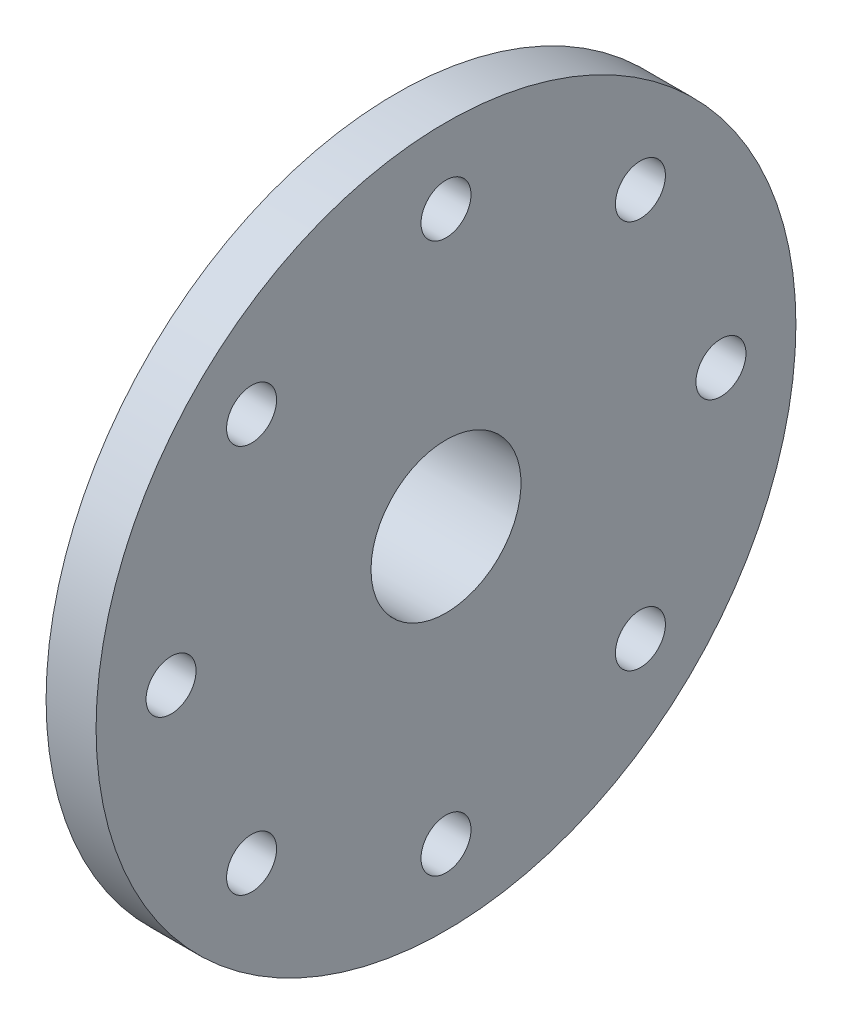
ISO-10303-21;
HEADER;
FILE_DESCRIPTION(('STEP AP214'),'2;1');
FILE_NAME('part.step','',(''),(''),'','','');
FILE_SCHEMA(('AUTOMOTIVE_DESIGN { 1 0 10303 214 1 1 1 1 }'));
ENDSEC;
DATA;
#1=APPLICATION_CONTEXT('core data for automotive mechanical design processes');
#2=APPLICATION_PROTOCOL_DEFINITION('international standard','automotive_design',2000,#1);
#3=PRODUCT_CONTEXT('',#1,'mechanical');
#4=PRODUCT('Part','Part','',(#3));
#5=PRODUCT_RELATED_PRODUCT_CATEGORY('part','',(#4));
#6=PRODUCT_DEFINITION_FORMATION('','',#4);
#7=PRODUCT_DEFINITION_CONTEXT('part definition',#1,'design');
#8=PRODUCT_DEFINITION('design','',#6,#7);
#9=PRODUCT_DEFINITION_SHAPE('','',#8);
#10=(LENGTH_UNIT() NAMED_UNIT(*) SI_UNIT(.MILLI.,.METRE.));
#11=(NAMED_UNIT(*) PLANE_ANGLE_UNIT() SI_UNIT($,.RADIAN.));
#12=(NAMED_UNIT(*) SI_UNIT($,.STERADIAN.) SOLID_ANGLE_UNIT());
#13=UNCERTAINTY_MEASURE_WITH_UNIT(LENGTH_MEASURE(1.E-05),#10,'distance_accuracy_value','');
#14=(GEOMETRIC_REPRESENTATION_CONTEXT(3) GLOBAL_UNCERTAINTY_ASSIGNED_CONTEXT((#13)) GLOBAL_UNIT_ASSIGNED_CONTEXT((#10,
#11,#12)) REPRESENTATION_CONTEXT('',''));
#15=CARTESIAN_POINT('',(0.,0.,0.));
#16=DIRECTION('',(0.,0.,1.));
#17=DIRECTION('',(1.,0.,0.));
#18=AXIS2_PLACEMENT_3D('',#15,#16,#17);
#19=CARTESIAN_POINT('',(-5.,1.5,0.));
#20=DIRECTION('',(1.,0.,0.));
#21=DIRECTION('',(0.,0.,-1.));
#22=AXIS2_PLACEMENT_3D('',#19,#20,#21);
#23=PLANE('',#22);
#24=CARTESIAN_POINT('',(-5.,0.,0.));
#25=DIRECTION('',(-1.,0.,0.));
#26=DIRECTION('',(0.,0.,1.));
#27=AXIS2_PLACEMENT_3D('',#24,#25,#26);
#28=CIRCLE('',#27,1.5);
#29=CARTESIAN_POINT('',(-5.,0.,1.5));
#30=VERTEX_POINT('',#29);
#31=EDGE_CURVE('E42',#30,#30,#28,.T.);
#32=ORIENTED_EDGE('',*,*,#31,.F.);
#33=EDGE_LOOP('',(#32));
#34=FACE_BOUND('',#33,.T.);
#35=CARTESIAN_POINT('',(-5.,0.,0.));
#36=DIRECTION('',(-1.,0.,0.));
#37=DIRECTION('',(0.,0.,1.));
#38=AXIS2_PLACEMENT_3D('',#35,#36,#37);
#39=CIRCLE('',#38,3.75);
#40=CARTESIAN_POINT('',(-5.,0.,3.75));
#41=VERTEX_POINT('',#40);
#42=EDGE_CURVE('E10',#41,#41,#39,.T.);
#43=ORIENTED_EDGE('',*,*,#42,.T.);
#44=EDGE_LOOP('',(#43));
#45=FACE_BOUND('',#44,.T.);
#46=ADVANCED_FACE('F14',(#34,#45),#23,.F.);
#47=CARTESIAN_POINT('',(0.,0.,0.));
#48=DIRECTION('',(-1.,0.,0.));
#49=DIRECTION('',(0.,0.,1.));
#50=AXIS2_PLACEMENT_3D('',#47,#48,#49);
#51=CYLINDRICAL_SURFACE('',#50,3.75);
#52=ORIENTED_EDGE('',*,*,#42,.F.);
#53=EDGE_LOOP('',(#52));
#54=FACE_BOUND('',#53,.T.);
#55=CARTESIAN_POINT('',(-2.,0.,0.));
#56=DIRECTION('',(-1.,0.,0.));
#57=DIRECTION('',(0.,0.,1.));
#58=AXIS2_PLACEMENT_3D('',#55,#56,#57);
#59=CIRCLE('',#58,3.75);
#60=CARTESIAN_POINT('',(-2.,0.,3.75));
#61=VERTEX_POINT('',#60);
#62=EDGE_CURVE('E20',#61,#61,#59,.T.);
#63=ORIENTED_EDGE('',*,*,#62,.T.);
#64=EDGE_LOOP('',(#63));
#65=FACE_BOUND('',#64,.T.);
#66=ADVANCED_FACE('F140',(#54,#65),#51,.T.);
#67=CARTESIAN_POINT('',(-2.,3.75,0.));
#68=DIRECTION('',(1.,0.,0.));
#69=DIRECTION('',(0.,0.,-1.));
#70=AXIS2_PLACEMENT_3D('',#67,#68,#69);
#71=PLANE('',#70);
#72=CARTESIAN_POINT('',(-2.,7.77817459305212,7.77817459305193));
#73=DIRECTION('',(1.,0.,0.));
#74=DIRECTION('',(0.,0.,-1.));
#75=AXIS2_PLACEMENT_3D('',#72,#73,#74);
#76=CIRCLE('',#75,1.);
#77=CARTESIAN_POINT('',(-2.,7.77817459305212,6.77817459305193));
#78=VERTEX_POINT('',#77);
#79=EDGE_CURVE('E87',#78,#78,#76,.T.);
#80=ORIENTED_EDGE('',*,*,#79,.T.);
#81=EDGE_LOOP('',(#80));
#82=FACE_BOUND('',#81,.T.);
#83=CARTESIAN_POINT('',(-2.,1.15218884181823E-13,11.));
#84=DIRECTION('',(1.,0.,0.));
#85=DIRECTION('',(0.,0.,-1.));
#86=AXIS2_PLACEMENT_3D('',#83,#84,#85);
#87=CIRCLE('',#86,1.);
#88=CARTESIAN_POINT('',(-2.,1.15218884181823E-13,10.));
#89=VERTEX_POINT('',#88);
#90=EDGE_CURVE('E81',#89,#89,#87,.T.);
#91=ORIENTED_EDGE('',*,*,#90,.T.);
#92=EDGE_LOOP('',(#91));
#93=FACE_BOUND('',#92,.T.);
#94=CARTESIAN_POINT('',(-2.,-7.77817459305195,7.77817459305209));
#95=DIRECTION('',(1.,0.,0.));
#96=DIRECTION('',(0.,0.,-1.));
#97=AXIS2_PLACEMENT_3D('',#94,#95,#96);
#98=CIRCLE('',#97,1.);
#99=CARTESIAN_POINT('',(-2.,-7.77817459305195,6.77817459305209));
#100=VERTEX_POINT('',#99);
#101=EDGE_CURVE('E75',#100,#100,#98,.T.);
#102=ORIENTED_EDGE('',*,*,#101,.T.);
#103=EDGE_LOOP('',(#102));
#104=FACE_BOUND('',#103,.T.);
#105=CARTESIAN_POINT('',(-2.,-11.,0.));
#106=DIRECTION('',(1.,0.,0.));
#107=DIRECTION('',(0.,0.,-1.));
#108=AXIS2_PLACEMENT_3D('',#105,#106,#107);
#109=CIRCLE('',#108,1.);
#110=CARTESIAN_POINT('',(-2.,-11.,-1.));
#111=VERTEX_POINT('',#110);
#112=EDGE_CURVE('E69',#111,#111,#109,.T.);
#113=ORIENTED_EDGE('',*,*,#112,.T.);
#114=EDGE_LOOP('',(#113));
#115=FACE_BOUND('',#114,.T.);
#116=CARTESIAN_POINT('',(-2.,-7.77817459305206,-7.77817459305198));
#117=DIRECTION('',(1.,0.,0.));
#118=DIRECTION('',(0.,0.,-1.));
#119=AXIS2_PLACEMENT_3D('',#116,#117,#118);
#120=CIRCLE('',#119,1.);
#121=CARTESIAN_POINT('',(-2.,-7.77817459305206,-8.77817459305198));
#122=VERTEX_POINT('',#121);
#123=EDGE_CURVE('E63',#122,#122,#120,.T.);
#124=ORIENTED_EDGE('',*,*,#123,.T.);
#125=EDGE_LOOP('',(#124));
#126=FACE_BOUND('',#125,.T.);
#127=CARTESIAN_POINT('',(-2.,0.,-11.));
#128=DIRECTION('',(1.,0.,0.));
#129=DIRECTION('',(0.,0.,-1.));
#130=AXIS2_PLACEMENT_3D('',#127,#128,#129);
#131=CIRCLE('',#130,1.);
#132=CARTESIAN_POINT('',(-2.,0.,-12.));
#133=VERTEX_POINT('',#132);
#134=EDGE_CURVE('E57',#133,#133,#131,.T.);
#135=ORIENTED_EDGE('',*,*,#134,.T.);
#136=EDGE_LOOP('',(#135));
#137=FACE_BOUND('',#136,.T.);
#138=CARTESIAN_POINT('',(-2.,7.77817459305201,-7.77817459305204));
#139=DIRECTION('',(1.,0.,0.));
#140=DIRECTION('',(0.,0.,-1.));
#141=AXIS2_PLACEMENT_3D('',#138,#139,#140);
#142=CIRCLE('',#141,1.);
#143=CARTESIAN_POINT('',(-2.,7.77817459305201,-8.77817459305204));
#144=VERTEX_POINT('',#143);
#145=EDGE_CURVE('E51',#144,#144,#142,.T.);
#146=ORIENTED_EDGE('',*,*,#145,.T.);
#147=EDGE_LOOP('',(#146));
#148=FACE_BOUND('',#147,.T.);
#149=CARTESIAN_POINT('',(-2.,11.,0.));
#150=DIRECTION('',(1.,0.,0.));
#151=DIRECTION('',(0.,0.,-1.));
#152=AXIS2_PLACEMENT_3D('',#149,#150,#151);
#153=CIRCLE('',#152,1.);
#154=CARTESIAN_POINT('',(-2.,11.,-1.));
#155=VERTEX_POINT('',#154);
#156=EDGE_CURVE('E45',#155,#155,#153,.T.);
#157=ORIENTED_EDGE('',*,*,#156,.T.);
#158=EDGE_LOOP('',(#157));
#159=FACE_BOUND('',#158,.T.);
#160=ORIENTED_EDGE('',*,*,#62,.F.);
#161=EDGE_LOOP('',(#160));
#162=FACE_BOUND('',#161,.T.);
#163=CARTESIAN_POINT('',(-2.,0.,0.));
#164=DIRECTION('',(-1.,0.,0.));
#165=DIRECTION('',(0.,0.,1.));
#166=AXIS2_PLACEMENT_3D('',#163,#164,#165);
#167=CIRCLE('',#166,14.);
#168=CARTESIAN_POINT('',(-2.,0.,14.));
#169=VERTEX_POINT('',#168);
#170=EDGE_CURVE('E24',#169,#169,#167,.T.);
#171=ORIENTED_EDGE('',*,*,#170,.T.);
#172=EDGE_LOOP('',(#171));
#173=FACE_BOUND('',#172,.T.);
#174=ADVANCED_FACE('F146',(#82,#93,#104,#115,#126,#137,#148,#159,#162,#173),#71,.F.);
#175=CARTESIAN_POINT('',(0.,0.,0.));
#176=DIRECTION('',(-1.,0.,0.));
#177=DIRECTION('',(0.,0.,1.));
#178=AXIS2_PLACEMENT_3D('',#175,#176,#177);
#179=CYLINDRICAL_SURFACE('',#178,14.);
#180=ORIENTED_EDGE('',*,*,#170,.F.);
#181=EDGE_LOOP('',(#180));
#182=FACE_BOUND('',#181,.T.);
#183=CARTESIAN_POINT('',(0.,0.,0.));
#184=DIRECTION('',(-1.,0.,0.));
#185=DIRECTION('',(0.,0.,1.));
#186=AXIS2_PLACEMENT_3D('',#183,#184,#185);
#187=CIRCLE('',#186,14.);
#188=CARTESIAN_POINT('',(0.,0.,14.));
#189=VERTEX_POINT('',#188);
#190=EDGE_CURVE('E28',#189,#189,#187,.T.);
#191=ORIENTED_EDGE('',*,*,#190,.T.);
#192=EDGE_LOOP('',(#191));
#193=FACE_BOUND('',#192,.T.);
#194=ADVANCED_FACE('F101',(#182,#193),#179,.T.);
#195=CARTESIAN_POINT('',(0.,14.,0.));
#196=DIRECTION('',(-1.,0.,0.));
#197=DIRECTION('',(0.,0.,1.));
#198=AXIS2_PLACEMENT_3D('',#195,#196,#197);
#199=PLANE('',#198);
#200=CARTESIAN_POINT('',(0.,7.77817459305212,7.77817459305193));
#201=DIRECTION('',(1.,0.,0.));
#202=DIRECTION('',(0.,0.707106781186539,-0.707106781186556));
#203=AXIS2_PLACEMENT_3D('',#200,#201,#202);
#204=CIRCLE('',#203,1.);
#205=CARTESIAN_POINT('',(0.,8.48528137423866,7.07106781186537));
#206=VERTEX_POINT('',#205);
#207=EDGE_CURVE('E90',#206,#206,#204,.T.);
#208=ORIENTED_EDGE('',*,*,#207,.F.);
#209=EDGE_LOOP('',(#208));
#210=FACE_BOUND('',#209,.T.);
#211=CARTESIAN_POINT('',(0.,1.15218884181823E-13,11.));
#212=DIRECTION('',(1.,0.,0.));
#213=DIRECTION('',(0.,1.,0.));
#214=AXIS2_PLACEMENT_3D('',#211,#212,#213);
#215=CIRCLE('',#214,1.);
#216=CARTESIAN_POINT('',(0.,1.00000000000012,11.));
#217=VERTEX_POINT('',#216);
#218=EDGE_CURVE('E84',#217,#217,#215,.T.);
#219=ORIENTED_EDGE('',*,*,#218,.F.);
#220=EDGE_LOOP('',(#219));
#221=FACE_BOUND('',#220,.T.);
#222=CARTESIAN_POINT('',(0.,-7.77817459305195,7.77817459305209));
#223=DIRECTION('',(1.,0.,0.));
#224=DIRECTION('',(0.,0.707106781186554,0.707106781186541));
#225=AXIS2_PLACEMENT_3D('',#222,#223,#224);
#226=CIRCLE('',#225,1.);
#227=CARTESIAN_POINT('',(0.,-7.0710678118654,8.48528137423863));
#228=VERTEX_POINT('',#227);
#229=EDGE_CURVE('E78',#228,#228,#226,.T.);
#230=ORIENTED_EDGE('',*,*,#229,.F.);
#231=EDGE_LOOP('',(#230));
#232=FACE_BOUND('',#231,.T.);
#233=CARTESIAN_POINT('',(0.,-11.,0.));
#234=DIRECTION('',(1.,0.,0.));
#235=DIRECTION('',(0.,0.,1.));
#236=AXIS2_PLACEMENT_3D('',#233,#234,#235);
#237=CIRCLE('',#236,1.);
#238=CARTESIAN_POINT('',(0.,-11.,1.));
#239=VERTEX_POINT('',#238);
#240=EDGE_CURVE('E72',#239,#239,#237,.T.);
#241=ORIENTED_EDGE('',*,*,#240,.F.);
#242=EDGE_LOOP('',(#241));
#243=FACE_BOUND('',#242,.T.);
#244=CARTESIAN_POINT('',(0.,-7.77817459305206,-7.77817459305198));
#245=DIRECTION('',(1.,0.,0.));
#246=DIRECTION('',(0.,-0.707106781186544,0.707106781186551));
#247=AXIS2_PLACEMENT_3D('',#244,#245,#246);
#248=CIRCLE('',#247,1.);
#249=CARTESIAN_POINT('',(0.,-8.48528137423861,-7.07106781186543));
#250=VERTEX_POINT('',#249);
#251=EDGE_CURVE('E66',#250,#250,#248,.T.);
#252=ORIENTED_EDGE('',*,*,#251,.F.);
#253=EDGE_LOOP('',(#252));
#254=FACE_BOUND('',#253,.T.);
#255=CARTESIAN_POINT('',(0.,0.,-11.));
#256=DIRECTION('',(1.,0.,0.));
#257=DIRECTION('',(0.,-1.,0.));
#258=AXIS2_PLACEMENT_3D('',#255,#256,#257);
#259=CIRCLE('',#258,1.);
#260=CARTESIAN_POINT('',(0.,-1.00000000000004,-11.));
#261=VERTEX_POINT('',#260);
#262=EDGE_CURVE('E60',#261,#261,#259,.T.);
#263=ORIENTED_EDGE('',*,*,#262,.F.);
#264=EDGE_LOOP('',(#263));
#265=FACE_BOUND('',#264,.T.);
#266=CARTESIAN_POINT('',(0.,7.77817459305201,-7.77817459305204));
#267=DIRECTION('',(1.,0.,0.));
#268=DIRECTION('',(0.,-0.707106781186549,-0.707106781186546));
#269=AXIS2_PLACEMENT_3D('',#266,#267,#268);
#270=CIRCLE('',#269,1.);
#271=CARTESIAN_POINT('',(0.,7.07106781186546,-8.48528137423859));
#272=VERTEX_POINT('',#271);
#273=EDGE_CURVE('E54',#272,#272,#270,.T.);
#274=ORIENTED_EDGE('',*,*,#273,.F.);
#275=EDGE_LOOP('',(#274));
#276=FACE_BOUND('',#275,.T.);
#277=CARTESIAN_POINT('',(0.,11.,0.));
#278=DIRECTION('',(1.,0.,0.));
#279=DIRECTION('',(0.,0.,-1.));
#280=AXIS2_PLACEMENT_3D('',#277,#278,#279);
#281=CIRCLE('',#280,1.);
#282=CARTESIAN_POINT('',(0.,11.,-1.));
#283=VERTEX_POINT('',#282);
#284=EDGE_CURVE('E48',#283,#283,#281,.T.);
#285=ORIENTED_EDGE('',*,*,#284,.F.);
#286=EDGE_LOOP('',(#285));
#287=FACE_BOUND('',#286,.T.);
#288=ORIENTED_EDGE('',*,*,#190,.F.);
#289=EDGE_LOOP('',(#288));
#290=FACE_BOUND('',#289,.T.);
#291=CARTESIAN_POINT('',(0.,0.,0.));
#292=DIRECTION('',(-1.,0.,0.));
#293=DIRECTION('',(0.,0.,1.));
#294=AXIS2_PLACEMENT_3D('',#291,#292,#293);
#295=CIRCLE('',#294,3.);
#296=CARTESIAN_POINT('',(0.,0.,3.));
#297=VERTEX_POINT('',#296);
#298=EDGE_CURVE('E33',#297,#297,#295,.T.);
#299=ORIENTED_EDGE('',*,*,#298,.T.);
#300=EDGE_LOOP('',(#299));
#301=FACE_BOUND('',#300,.T.);
#302=ADVANCED_FACE('F97',(#210,#221,#232,#243,#254,#265,#276,#287,#290,#301),#199,.F.);
#303=CARTESIAN_POINT('',(0.,0.,0.));
#304=DIRECTION('',(-1.,0.,0.));
#305=DIRECTION('',(0.,0.,1.));
#306=AXIS2_PLACEMENT_3D('',#303,#304,#305);
#307=CYLINDRICAL_SURFACE('',#306,3.);
#308=ORIENTED_EDGE('',*,*,#298,.F.);
#309=EDGE_LOOP('',(#308));
#310=FACE_BOUND('',#309,.T.);
#311=CARTESIAN_POINT('',(-4.5,0.,0.));
#312=DIRECTION('',(-1.,0.,0.));
#313=DIRECTION('',(0.,0.,1.));
#314=AXIS2_PLACEMENT_3D('',#311,#312,#313);
#315=CIRCLE('',#314,3.);
#316=CARTESIAN_POINT('',(-4.5,0.,3.));
#317=VERTEX_POINT('',#316);
#318=EDGE_CURVE('E36',#317,#317,#315,.T.);
#319=ORIENTED_EDGE('',*,*,#318,.T.);
#320=EDGE_LOOP('',(#319));
#321=FACE_BOUND('',#320,.T.);
#322=ADVANCED_FACE('F100',(#310,#321),#307,.F.);
#323=CARTESIAN_POINT('',(-4.5,3.,0.));
#324=DIRECTION('',(-1.,0.,0.));
#325=DIRECTION('',(0.,0.,1.));
#326=AXIS2_PLACEMENT_3D('',#323,#324,#325);
#327=PLANE('',#326);
#328=ORIENTED_EDGE('',*,*,#318,.F.);
#329=EDGE_LOOP('',(#328));
#330=FACE_BOUND('',#329,.T.);
#331=CARTESIAN_POINT('',(-4.5,0.,0.));
#332=DIRECTION('',(-1.,0.,0.));
#333=DIRECTION('',(0.,0.,1.));
#334=AXIS2_PLACEMENT_3D('',#331,#332,#333);
#335=CIRCLE('',#334,1.5);
#336=CARTESIAN_POINT('',(-4.5,0.,1.5));
#337=VERTEX_POINT('',#336);
#338=EDGE_CURVE('E39',#337,#337,#335,.T.);
#339=ORIENTED_EDGE('',*,*,#338,.T.);
#340=EDGE_LOOP('',(#339));
#341=FACE_BOUND('',#340,.T.);
#342=ADVANCED_FACE('F123',(#330,#341),#327,.F.);
#343=CARTESIAN_POINT('',(0.,0.,0.));
#344=DIRECTION('',(-1.,0.,0.));
#345=DIRECTION('',(0.,0.,1.));
#346=AXIS2_PLACEMENT_3D('',#343,#344,#345);
#347=CYLINDRICAL_SURFACE('',#346,1.5);
#348=ORIENTED_EDGE('',*,*,#338,.F.);
#349=EDGE_LOOP('',(#348));
#350=FACE_BOUND('',#349,.T.);
#351=ORIENTED_EDGE('',*,*,#31,.T.);
#352=EDGE_LOOP('',(#351));
#353=FACE_BOUND('',#352,.T.);
#354=ADVANCED_FACE('F129',(#350,#353),#347,.F.);
#355=CARTESIAN_POINT('',(-5.,11.,0.));
#356=DIRECTION('',(1.,0.,0.));
#357=DIRECTION('',(0.,0.,-1.));
#358=AXIS2_PLACEMENT_3D('',#355,#356,#357);
#359=CYLINDRICAL_SURFACE('',#358,1.);
#360=ORIENTED_EDGE('',*,*,#284,.T.);
#361=EDGE_LOOP('',(#360));
#362=FACE_BOUND('',#361,.T.);
#363=ORIENTED_EDGE('',*,*,#156,.F.);
#364=EDGE_LOOP('',(#363));
#365=FACE_BOUND('',#364,.T.);
#366=ADVANCED_FACE('F135',(#362,#365),#359,.F.);
#367=CARTESIAN_POINT('',(-5.,7.77817459305201,-7.77817459305204));
#368=DIRECTION('',(1.,0.,0.));
#369=DIRECTION('',(0.,0.,-1.));
#370=AXIS2_PLACEMENT_3D('',#367,#368,#369);
#371=CYLINDRICAL_SURFACE('',#370,1.);
#372=ORIENTED_EDGE('',*,*,#273,.T.);
#373=EDGE_LOOP('',(#372));
#374=FACE_BOUND('',#373,.T.);
#375=ORIENTED_EDGE('',*,*,#145,.F.);
#376=EDGE_LOOP('',(#375));
#377=FACE_BOUND('',#376,.T.);
#378=ADVANCED_FACE('F160',(#374,#377),#371,.F.);
#379=CARTESIAN_POINT('',(-5.,0.,-11.));
#380=DIRECTION('',(1.,0.,0.));
#381=DIRECTION('',(0.,0.,-1.));
#382=AXIS2_PLACEMENT_3D('',#379,#380,#381);
#383=CYLINDRICAL_SURFACE('',#382,1.);
#384=ORIENTED_EDGE('',*,*,#262,.T.);
#385=EDGE_LOOP('',(#384));
#386=FACE_BOUND('',#385,.T.);
#387=ORIENTED_EDGE('',*,*,#134,.F.);
#388=EDGE_LOOP('',(#387));
#389=FACE_BOUND('',#388,.T.);
#390=ADVANCED_FACE('F164',(#386,#389),#383,.F.);
#391=CARTESIAN_POINT('',(-5.,-7.77817459305206,-7.77817459305198));
#392=DIRECTION('',(1.,0.,0.));
#393=DIRECTION('',(0.,0.,-1.));
#394=AXIS2_PLACEMENT_3D('',#391,#392,#393);
#395=CYLINDRICAL_SURFACE('',#394,1.);
#396=ORIENTED_EDGE('',*,*,#251,.T.);
#397=EDGE_LOOP('',(#396));
#398=FACE_BOUND('',#397,.T.);
#399=ORIENTED_EDGE('',*,*,#123,.F.);
#400=EDGE_LOOP('',(#399));
#401=FACE_BOUND('',#400,.T.);
#402=ADVANCED_FACE('F168',(#398,#401),#395,.F.);
#403=CARTESIAN_POINT('',(-5.,-11.,0.));
#404=DIRECTION('',(1.,0.,0.));
#405=DIRECTION('',(0.,0.,-1.));
#406=AXIS2_PLACEMENT_3D('',#403,#404,#405);
#407=CYLINDRICAL_SURFACE('',#406,1.);
#408=ORIENTED_EDGE('',*,*,#240,.T.);
#409=EDGE_LOOP('',(#408));
#410=FACE_BOUND('',#409,.T.);
#411=ORIENTED_EDGE('',*,*,#112,.F.);
#412=EDGE_LOOP('',(#411));
#413=FACE_BOUND('',#412,.T.);
#414=ADVANCED_FACE('F172',(#410,#413),#407,.F.);
#415=CARTESIAN_POINT('',(-5.,-7.77817459305195,7.77817459305209));
#416=DIRECTION('',(1.,0.,0.));
#417=DIRECTION('',(0.,0.,-1.));
#418=AXIS2_PLACEMENT_3D('',#415,#416,#417);
#419=CYLINDRICAL_SURFACE('',#418,1.);
#420=ORIENTED_EDGE('',*,*,#229,.T.);
#421=EDGE_LOOP('',(#420));
#422=FACE_BOUND('',#421,.T.);
#423=ORIENTED_EDGE('',*,*,#101,.F.);
#424=EDGE_LOOP('',(#423));
#425=FACE_BOUND('',#424,.T.);
#426=ADVANCED_FACE('F176',(#422,#425),#419,.F.);
#427=CARTESIAN_POINT('',(-5.,1.15218884181823E-13,11.));
#428=DIRECTION('',(1.,0.,0.));
#429=DIRECTION('',(0.,0.,-1.));
#430=AXIS2_PLACEMENT_3D('',#427,#428,#429);
#431=CYLINDRICAL_SURFACE('',#430,1.);
#432=ORIENTED_EDGE('',*,*,#218,.T.);
#433=EDGE_LOOP('',(#432));
#434=FACE_BOUND('',#433,.T.);
#435=ORIENTED_EDGE('',*,*,#90,.F.);
#436=EDGE_LOOP('',(#435));
#437=FACE_BOUND('',#436,.T.);
#438=ADVANCED_FACE('F180',(#434,#437),#431,.F.);
#439=CARTESIAN_POINT('',(-5.,7.77817459305212,7.77817459305193));
#440=DIRECTION('',(1.,0.,0.));
#441=DIRECTION('',(0.,0.,-1.));
#442=AXIS2_PLACEMENT_3D('',#439,#440,#441);
#443=CYLINDRICAL_SURFACE('',#442,1.);
#444=ORIENTED_EDGE('',*,*,#207,.T.);
#445=EDGE_LOOP('',(#444));
#446=FACE_BOUND('',#445,.T.);
#447=ORIENTED_EDGE('',*,*,#79,.F.);
#448=EDGE_LOOP('',(#447));
#449=FACE_BOUND('',#448,.T.);
#450=ADVANCED_FACE('F94',(#446,#449),#443,.F.);
#451=CLOSED_SHELL('',(#46,#66,#174,#194,#302,#322,#342,#354,#366,#378,#390,#402,#414,#426,#438,#450));
#452=MANIFOLD_SOLID_BREP('B1',#451);
#453=ADVANCED_BREP_SHAPE_REPRESENTATION('',(#18,#452),#14);
#454=SHAPE_DEFINITION_REPRESENTATION(#9,#453);
ENDSEC;
END-ISO-10303-21;
